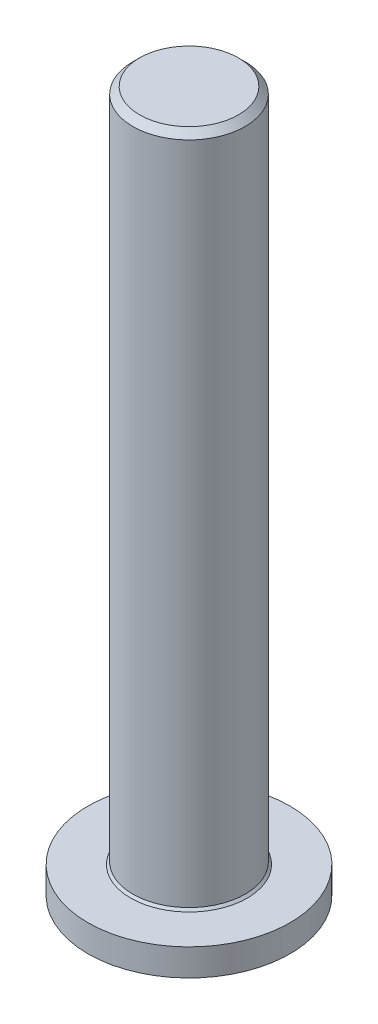
ISO-10303-21;
HEADER;
FILE_DESCRIPTION(('STEP AP214'),'2;1');
FILE_NAME('part.step','',(''),(''),'','','');
FILE_SCHEMA(('AUTOMOTIVE_DESIGN { 1 0 10303 214 1 1 1 1 }'));
ENDSEC;
DATA;
#1=APPLICATION_CONTEXT('core data for automotive mechanical design processes');
#2=APPLICATION_PROTOCOL_DEFINITION('international standard','automotive_design',2000,#1);
#3=PRODUCT_CONTEXT('',#1,'mechanical');
#4=PRODUCT('Part','Part','',(#3));
#5=PRODUCT_RELATED_PRODUCT_CATEGORY('part','',(#4));
#6=PRODUCT_DEFINITION_FORMATION('','',#4);
#7=PRODUCT_DEFINITION_CONTEXT('part definition',#1,'design');
#8=PRODUCT_DEFINITION('design','',#6,#7);
#9=PRODUCT_DEFINITION_SHAPE('','',#8);
#10=(LENGTH_UNIT() NAMED_UNIT(*) SI_UNIT(.MILLI.,.METRE.));
#11=(NAMED_UNIT(*) PLANE_ANGLE_UNIT() SI_UNIT($,.RADIAN.));
#12=(NAMED_UNIT(*) SI_UNIT($,.STERADIAN.) SOLID_ANGLE_UNIT());
#13=UNCERTAINTY_MEASURE_WITH_UNIT(LENGTH_MEASURE(1.E-05),#10,'distance_accuracy_value','');
#14=(GEOMETRIC_REPRESENTATION_CONTEXT(3) GLOBAL_UNCERTAINTY_ASSIGNED_CONTEXT((#13)) GLOBAL_UNIT_ASSIGNED_CONTEXT((#10,
#11,#12)) REPRESENTATION_CONTEXT('',''));
#15=CARTESIAN_POINT('',(0.,0.,0.));
#16=DIRECTION('',(0.,0.,1.));
#17=DIRECTION('',(1.,0.,0.));
#18=AXIS2_PLACEMENT_3D('',#15,#16,#17);
#19=CARTESIAN_POINT('',(0.,1.5,0.));
#20=DIRECTION('',(0.,1.,0.));
#21=DIRECTION('',(0.,0.,1.));
#22=AXIS2_PLACEMENT_3D('',#19,#20,#21);
#23=PLANE('',#22);
#24=CARTESIAN_POINT('',(0.,1.5,0.));
#25=DIRECTION('',(0.,1.,0.));
#26=DIRECTION('',(0.,0.,1.));
#27=AXIS2_PLACEMENT_3D('',#24,#25,#26);
#28=CIRCLE('',#27,2.59999999999999);
#29=CARTESIAN_POINT('',(0.,1.5,2.59999999999999));
#30=VERTEX_POINT('',#29);
#31=EDGE_CURVE('E147',#30,#30,#28,.F.);
#32=ORIENTED_EDGE('',*,*,#31,.T.);
#33=EDGE_LOOP('',(#32));
#34=FACE_BOUND('',#33,.T.);
#35=CARTESIAN_POINT('',(0.,1.5,0.));
#36=DIRECTION('',(0.,1.,0.));
#37=DIRECTION('',(0.,0.,1.));
#38=AXIS2_PLACEMENT_3D('',#35,#36,#37);
#39=CIRCLE('',#38,4.5);
#40=CARTESIAN_POINT('',(0.,1.5,4.5));
#41=VERTEX_POINT('',#40);
#42=EDGE_CURVE('E136',#41,#41,#39,.T.);
#43=ORIENTED_EDGE('',*,*,#42,.T.);
#44=EDGE_LOOP('',(#43));
#45=FACE_BOUND('',#44,.T.);
#46=ADVANCED_FACE('F34',(#34,#45),#23,.T.);
#47=CARTESIAN_POINT('',(0.,1.5,0.));
#48=DIRECTION('',(0.,-1.,0.));
#49=DIRECTION('',(0.,0.,-1.));
#50=AXIS2_PLACEMENT_3D('',#47,#48,#49);
#51=CYLINDRICAL_SURFACE('',#50,4.5);
#52=CARTESIAN_POINT('',(0.,0.3,0.));
#53=DIRECTION('',(0.,1.,0.));
#54=DIRECTION('',(0.,0.,1.));
#55=AXIS2_PLACEMENT_3D('',#52,#53,#54);
#56=CIRCLE('',#55,4.5);
#57=CARTESIAN_POINT('',(0.,0.3,4.5));
#58=VERTEX_POINT('',#57);
#59=EDGE_CURVE('E150',#58,#58,#56,.T.);
#60=ORIENTED_EDGE('',*,*,#59,.T.);
#61=EDGE_LOOP('',(#60));
#62=FACE_BOUND('',#61,.T.);
#63=ORIENTED_EDGE('',*,*,#42,.F.);
#64=EDGE_LOOP('',(#63));
#65=FACE_BOUND('',#64,.T.);
#66=ADVANCED_FACE('F169',(#62,#65),#51,.T.);
#67=CARTESIAN_POINT('',(0.,0.,0.));
#68=DIRECTION('',(0.,1.,0.));
#69=DIRECTION('',(0.,0.,1.));
#70=AXIS2_PLACEMENT_3D('',#67,#68,#69);
#71=PLANE('',#70);
#72=DIRECTION('',(-0.717801415460528,0.,-0.696247892609279));
#73=VECTOR('',#72,1.);
#74=CARTESIAN_POINT('',(-0.422737578252671,0.,1.6796704855218));
#75=LINE('',#74,#73);
#76=CARTESIAN_POINT('',(-0.422737578252671,0.,1.6796704855218));
#77=VERTEX_POINT('',#76);
#78=CARTESIAN_POINT('',(-1.66600609957516,0.,0.473733760859775));
#79=VERTEX_POINT('',#78);
#80=EDGE_CURVE('E123',#77,#79,#75,.T.);
#81=ORIENTED_EDGE('',*,*,#80,.F.);
#82=DIRECTION('',(-0.961869070061279,0.,0.273510314356606));
#83=VECTOR('',#82,1.);
#84=CARTESIAN_POINT('',(1.24326852132249,0.,1.20593672466203));
#85=LINE('',#84,#83);
#86=CARTESIAN_POINT('',(1.24326852132249,0.,1.20593672466203));
#87=VERTEX_POINT('',#86);
#88=EDGE_CURVE('E49',#87,#77,#85,.T.);
#89=ORIENTED_EDGE('',*,*,#88,.F.);
#90=DIRECTION('',(-0.244067654600751,0.,0.969758206965885));
#91=VECTOR('',#90,1.);
#92=CARTESIAN_POINT('',(1.66600609957516,0.,-0.473733760859776));
#93=LINE('',#92,#91);
#94=CARTESIAN_POINT('',(1.66600609957516,0.,-0.473733760859776));
#95=VERTEX_POINT('',#94);
#96=EDGE_CURVE('E132',#95,#87,#93,.T.);
#97=ORIENTED_EDGE('',*,*,#96,.F.);
#98=DIRECTION('',(0.717801415460528,0.,0.696247892609279));
#99=VECTOR('',#98,1.);
#100=CARTESIAN_POINT('',(0.422737578252671,0.,-1.6796704855218));
#101=LINE('',#100,#99);
#102=CARTESIAN_POINT('',(0.422737578252671,0.,-1.6796704855218));
#103=VERTEX_POINT('',#102);
#104=EDGE_CURVE('E130',#103,#95,#101,.T.);
#105=ORIENTED_EDGE('',*,*,#104,.F.);
#106=DIRECTION('',(0.961869070061279,0.,-0.273510314356606));
#107=VECTOR('',#106,1.);
#108=CARTESIAN_POINT('',(-1.24326852132249,0.,-1.20593672466203));
#109=LINE('',#108,#107);
#110=CARTESIAN_POINT('',(-1.24326852132249,0.,-1.20593672466203));
#111=VERTEX_POINT('',#110);
#112=EDGE_CURVE('E97',#111,#103,#109,.T.);
#113=ORIENTED_EDGE('',*,*,#112,.F.);
#114=DIRECTION('',(0.244067654600751,0.,-0.969758206965885));
#115=VECTOR('',#114,1.);
#116=CARTESIAN_POINT('',(-1.66600609957516,0.,0.473733760859775));
#117=LINE('',#116,#115);
#118=EDGE_CURVE('E126',#79,#111,#117,.T.);
#119=ORIENTED_EDGE('',*,*,#118,.F.);
#120=EDGE_LOOP('',(#81,#89,#97,#105,#113,#119));
#121=FACE_BOUND('',#120,.T.);
#122=CARTESIAN_POINT('',(0.,0.,0.));
#123=DIRECTION('',(0.,1.,0.));
#124=DIRECTION('',(0.,0.,1.));
#125=AXIS2_PLACEMENT_3D('',#122,#123,#124);
#126=CIRCLE('',#125,3.75);
#127=CARTESIAN_POINT('',(0.,0.,3.75));
#128=VERTEX_POINT('',#127);
#129=EDGE_CURVE('E153',#128,#128,#126,.F.);
#130=ORIENTED_EDGE('',*,*,#129,.T.);
#131=EDGE_LOOP('',(#130));
#132=FACE_BOUND('',#131,.T.);
#133=ADVANCED_FACE('F175',(#121,#132),#71,.F.);
#134=CARTESIAN_POINT('',(0.,31.5,0.));
#135=DIRECTION('',(0.,-1.,0.));
#136=DIRECTION('',(0.,0.,-1.));
#137=AXIS2_PLACEMENT_3D('',#134,#135,#136);
#138=CYLINDRICAL_SURFACE('',#137,2.5);
#139=CARTESIAN_POINT('',(0.,31.2,0.));
#140=DIRECTION('',(0.,1.,0.));
#141=DIRECTION('',(0.,0.,1.));
#142=AXIS2_PLACEMENT_3D('',#139,#140,#141);
#143=CIRCLE('',#142,2.5);
#144=CARTESIAN_POINT('',(0.,31.2,2.5));
#145=VERTEX_POINT('',#144);
#146=EDGE_CURVE('E11',#145,#145,#143,.F.);
#147=ORIENTED_EDGE('',*,*,#146,.T.);
#148=EDGE_LOOP('',(#147));
#149=FACE_BOUND('',#148,.T.);
#150=CARTESIAN_POINT('',(0.,1.59999999999999,0.));
#151=DIRECTION('',(0.,1.,0.));
#152=DIRECTION('',(0.,0.,1.));
#153=AXIS2_PLACEMENT_3D('',#150,#151,#152);
#154=CIRCLE('',#153,2.5);
#155=CARTESIAN_POINT('',(0.,1.59999999999999,2.5));
#156=VERTEX_POINT('',#155);
#157=EDGE_CURVE('E144',#156,#156,#154,.T.);
#158=ORIENTED_EDGE('',*,*,#157,.T.);
#159=EDGE_LOOP('',(#158));
#160=FACE_BOUND('',#159,.T.);
#161=ADVANCED_FACE('F181',(#149,#160),#138,.T.);
#162=CARTESIAN_POINT('',(0.,31.5,0.));
#163=DIRECTION('',(0.,1.,0.));
#164=DIRECTION('',(0.,0.,1.));
#165=AXIS2_PLACEMENT_3D('',#162,#163,#164);
#166=PLANE('',#165);
#167=CARTESIAN_POINT('',(0.,31.5,0.));
#168=DIRECTION('',(0.,1.,0.));
#169=DIRECTION('',(0.,0.,1.));
#170=AXIS2_PLACEMENT_3D('',#167,#168,#169);
#171=CIRCLE('',#170,2.2);
#172=CARTESIAN_POINT('',(0.,31.5,2.2));
#173=VERTEX_POINT('',#172);
#174=EDGE_CURVE('E42',#173,#173,#171,.T.);
#175=ORIENTED_EDGE('',*,*,#174,.T.);
#176=EDGE_LOOP('',(#175));
#177=FACE_BOUND('',#176,.T.);
#178=ADVANCED_FACE('F158',(#177),#166,.T.);
#179=CARTESIAN_POINT('',(0.,1.59999999999999,0.));
#180=DIRECTION('',(0.,-1.,0.));
#181=DIRECTION('',(0.,0.,-1.));
#182=AXIS2_PLACEMENT_3D('',#179,#180,#181);
#183=CONICAL_SURFACE('',#182,2.5,0.785398163397459);
#184=ORIENTED_EDGE('',*,*,#31,.F.);
#185=EDGE_LOOP('',(#184));
#186=FACE_BOUND('',#185,.T.);
#187=ORIENTED_EDGE('',*,*,#157,.F.);
#188=EDGE_LOOP('',(#187));
#189=FACE_BOUND('',#188,.T.);
#190=ADVANCED_FACE('F186',(#186,#189),#183,.T.);
#191=CARTESIAN_POINT('',(0.,0.3,0.));
#192=DIRECTION('',(0.,1.,0.));
#193=DIRECTION('',(0.,0.,1.));
#194=AXIS2_PLACEMENT_3D('',#191,#192,#193);
#195=CONICAL_SURFACE('',#194,4.5,1.19028994968253);
#196=ORIENTED_EDGE('',*,*,#129,.F.);
#197=EDGE_LOOP('',(#196));
#198=FACE_BOUND('',#197,.T.);
#199=ORIENTED_EDGE('',*,*,#59,.F.);
#200=EDGE_LOOP('',(#199));
#201=FACE_BOUND('',#200,.T.);
#202=ADVANCED_FACE('F188',(#198,#201),#195,.T.);
#203=CARTESIAN_POINT('',(1.24326852132249,3.,1.20593672466203));
#204=DIRECTION('',(0.273510314356606,0.,0.961869070061279));
#205=DIRECTION('',(0.961869070061279,0.,-0.273510314356606));
#206=AXIS2_PLACEMENT_3D('',#203,#204,#205);
#207=PLANE('',#206);
#208=ORIENTED_EDGE('',*,*,#88,.T.);
#209=DIRECTION('',(0.,-1.,0.));
#210=VECTOR('',#209,1.);
#211=CARTESIAN_POINT('',(-0.422737578252671,3.,1.6796704855218));
#212=LINE('',#211,#210);
#213=CARTESIAN_POINT('',(-0.422737578252671,3.,1.6796704855218));
#214=VERTEX_POINT('',#213);
#215=EDGE_CURVE('E79',#214,#77,#212,.T.);
#216=ORIENTED_EDGE('',*,*,#215,.F.);
#217=DIRECTION('',(-0.961869070061279,0.,0.273510314356606));
#218=VECTOR('',#217,1.);
#219=CARTESIAN_POINT('',(1.24326852132249,3.,1.20593672466203));
#220=LINE('',#219,#218);
#221=CARTESIAN_POINT('',(1.24326852132249,3.,1.20593672466203));
#222=VERTEX_POINT('',#221);
#223=EDGE_CURVE('E134',#222,#214,#220,.T.);
#224=ORIENTED_EDGE('',*,*,#223,.F.);
#225=DIRECTION('',(0.,-1.,0.));
#226=VECTOR('',#225,1.);
#227=CARTESIAN_POINT('',(1.24326852132249,3.,1.20593672466203));
#228=LINE('',#227,#226);
#229=EDGE_CURVE('E57',#222,#87,#228,.T.);
#230=ORIENTED_EDGE('',*,*,#229,.T.);
#231=EDGE_LOOP('',(#208,#216,#224,#230));
#232=FACE_BOUND('',#231,.T.);
#233=ADVANCED_FACE('F191',(#232),#207,.F.);
#234=CARTESIAN_POINT('',(1.66600609957516,3.,-0.473733760859776));
#235=DIRECTION('',(0.969758206965885,0.,0.244067654600751));
#236=DIRECTION('',(0.244067654600751,0.,-0.969758206965885));
#237=AXIS2_PLACEMENT_3D('',#234,#235,#236);
#238=PLANE('',#237);
#239=ORIENTED_EDGE('',*,*,#96,.T.);
#240=ORIENTED_EDGE('',*,*,#229,.F.);
#241=DIRECTION('',(-0.244067654600751,0.,0.969758206965885));
#242=VECTOR('',#241,1.);
#243=CARTESIAN_POINT('',(1.66600609957516,3.,-0.473733760859776));
#244=LINE('',#243,#242);
#245=CARTESIAN_POINT('',(1.66600609957516,3.,-0.473733760859776));
#246=VERTEX_POINT('',#245);
#247=EDGE_CURVE('E109',#246,#222,#244,.T.);
#248=ORIENTED_EDGE('',*,*,#247,.F.);
#249=DIRECTION('',(0.,-1.,0.));
#250=VECTOR('',#249,1.);
#251=CARTESIAN_POINT('',(1.66600609957516,3.,-0.473733760859776));
#252=LINE('',#251,#250);
#253=EDGE_CURVE('E101',#246,#95,#252,.T.);
#254=ORIENTED_EDGE('',*,*,#253,.T.);
#255=EDGE_LOOP('',(#239,#240,#248,#254));
#256=FACE_BOUND('',#255,.T.);
#257=ADVANCED_FACE('F196',(#256),#238,.F.);
#258=CARTESIAN_POINT('',(0.422737578252671,3.,-1.6796704855218));
#259=DIRECTION('',(0.696247892609279,0.,-0.717801415460528));
#260=DIRECTION('',(-0.717801415460528,0.,-0.696247892609279));
#261=AXIS2_PLACEMENT_3D('',#258,#259,#260);
#262=PLANE('',#261);
#263=ORIENTED_EDGE('',*,*,#104,.T.);
#264=ORIENTED_EDGE('',*,*,#253,.F.);
#265=DIRECTION('',(0.717801415460528,0.,0.696247892609279));
#266=VECTOR('',#265,1.);
#267=CARTESIAN_POINT('',(0.422737578252671,3.,-1.6796704855218));
#268=LINE('',#267,#266);
#269=CARTESIAN_POINT('',(0.422737578252671,3.,-1.6796704855218));
#270=VERTEX_POINT('',#269);
#271=EDGE_CURVE('E105',#270,#246,#268,.T.);
#272=ORIENTED_EDGE('',*,*,#271,.F.);
#273=DIRECTION('',(0.,-1.,0.));
#274=VECTOR('',#273,1.);
#275=CARTESIAN_POINT('',(0.422737578252671,3.,-1.6796704855218));
#276=LINE('',#275,#274);
#277=EDGE_CURVE('E90',#270,#103,#276,.T.);
#278=ORIENTED_EDGE('',*,*,#277,.T.);
#279=EDGE_LOOP('',(#263,#264,#272,#278));
#280=FACE_BOUND('',#279,.T.);
#281=ADVANCED_FACE('F106',(#280),#262,.F.);
#282=CARTESIAN_POINT('',(-1.24326852132249,3.,-1.20593672466203));
#283=DIRECTION('',(-0.273510314356606,0.,-0.961869070061279));
#284=DIRECTION('',(-0.961869070061279,0.,0.273510314356606));
#285=AXIS2_PLACEMENT_3D('',#282,#283,#284);
#286=PLANE('',#285);
#287=ORIENTED_EDGE('',*,*,#112,.T.);
#288=ORIENTED_EDGE('',*,*,#277,.F.);
#289=DIRECTION('',(0.961869070061279,0.,-0.273510314356606));
#290=VECTOR('',#289,1.);
#291=CARTESIAN_POINT('',(-1.24326852132249,3.,-1.20593672466203));
#292=LINE('',#291,#290);
#293=CARTESIAN_POINT('',(-1.24326852132249,3.,-1.20593672466203));
#294=VERTEX_POINT('',#293);
#295=EDGE_CURVE('E94',#294,#270,#292,.T.);
#296=ORIENTED_EDGE('',*,*,#295,.F.);
#297=DIRECTION('',(0.,-1.,0.));
#298=VECTOR('',#297,1.);
#299=CARTESIAN_POINT('',(-1.24326852132249,3.,-1.20593672466203));
#300=LINE('',#299,#298);
#301=EDGE_CURVE('E102',#294,#111,#300,.T.);
#302=ORIENTED_EDGE('',*,*,#301,.T.);
#303=EDGE_LOOP('',(#287,#288,#296,#302));
#304=FACE_BOUND('',#303,.T.);
#305=ADVANCED_FACE('F92',(#304),#286,.F.);
#306=CARTESIAN_POINT('',(-1.66600609957516,3.,0.473733760859775));
#307=DIRECTION('',(-0.969758206965885,0.,-0.244067654600751));
#308=DIRECTION('',(-0.244067654600751,0.,0.969758206965885));
#309=AXIS2_PLACEMENT_3D('',#306,#307,#308);
#310=PLANE('',#309);
#311=ORIENTED_EDGE('',*,*,#118,.T.);
#312=ORIENTED_EDGE('',*,*,#301,.F.);
#313=DIRECTION('',(0.244067654600751,0.,-0.969758206965885));
#314=VECTOR('',#313,1.);
#315=CARTESIAN_POINT('',(-1.66600609957516,3.,0.473733760859775));
#316=LINE('',#315,#314);
#317=CARTESIAN_POINT('',(-1.66600609957516,3.,0.473733760859775));
#318=VERTEX_POINT('',#317);
#319=EDGE_CURVE('E115',#318,#294,#316,.T.);
#320=ORIENTED_EDGE('',*,*,#319,.F.);
#321=DIRECTION('',(0.,-1.,0.));
#322=VECTOR('',#321,1.);
#323=CARTESIAN_POINT('',(-1.66600609957516,3.,0.473733760859775));
#324=LINE('',#323,#322);
#325=EDGE_CURVE('E139',#318,#79,#324,.T.);
#326=ORIENTED_EDGE('',*,*,#325,.T.);
#327=EDGE_LOOP('',(#311,#312,#320,#326));
#328=FACE_BOUND('',#327,.T.);
#329=ADVANCED_FACE('F265',(#328),#310,.F.);
#330=CARTESIAN_POINT('',(-0.422737578252671,3.,1.6796704855218));
#331=DIRECTION('',(-0.696247892609279,0.,0.717801415460528));
#332=DIRECTION('',(0.717801415460528,0.,0.696247892609279));
#333=AXIS2_PLACEMENT_3D('',#330,#331,#332);
#334=PLANE('',#333);
#335=ORIENTED_EDGE('',*,*,#80,.T.);
#336=ORIENTED_EDGE('',*,*,#325,.F.);
#337=DIRECTION('',(-0.717801415460528,0.,-0.696247892609279));
#338=VECTOR('',#337,1.);
#339=CARTESIAN_POINT('',(-0.422737578252671,3.,1.6796704855218));
#340=LINE('',#339,#338);
#341=EDGE_CURVE('E117',#214,#318,#340,.T.);
#342=ORIENTED_EDGE('',*,*,#341,.F.);
#343=ORIENTED_EDGE('',*,*,#215,.T.);
#344=EDGE_LOOP('',(#335,#336,#342,#343));
#345=FACE_BOUND('',#344,.T.);
#346=ADVANCED_FACE('F165',(#345),#334,.F.);
#347=CARTESIAN_POINT('',(0.,3.,0.));
#348=DIRECTION('',(0.,-1.,0.));
#349=DIRECTION('',(0.,0.,-1.));
#350=AXIS2_PLACEMENT_3D('',#347,#348,#349);
#351=PLANE('',#350);
#352=ORIENTED_EDGE('',*,*,#223,.T.);
#353=ORIENTED_EDGE('',*,*,#341,.T.);
#354=ORIENTED_EDGE('',*,*,#319,.T.);
#355=ORIENTED_EDGE('',*,*,#295,.T.);
#356=ORIENTED_EDGE('',*,*,#271,.T.);
#357=ORIENTED_EDGE('',*,*,#247,.T.);
#358=EDGE_LOOP('',(#352,#353,#354,#355,#356,#357));
#359=FACE_BOUND('',#358,.T.);
#360=ADVANCED_FACE('F112',(#359),#351,.T.);
#361=CARTESIAN_POINT('',(0.,31.5,0.));
#362=DIRECTION('',(0.,-1.,0.));
#363=DIRECTION('',(0.,0.,-1.));
#364=AXIS2_PLACEMENT_3D('',#361,#362,#363);
#365=CONICAL_SURFACE('',#364,2.2,0.78539816339745);
#366=ORIENTED_EDGE('',*,*,#146,.F.);
#367=EDGE_LOOP('',(#366));
#368=FACE_BOUND('',#367,.T.);
#369=ORIENTED_EDGE('',*,*,#174,.F.);
#370=EDGE_LOOP('',(#369));
#371=FACE_BOUND('',#370,.T.);
#372=ADVANCED_FACE('F36',(#368,#371),#365,.T.);
#373=CLOSED_SHELL('',(#46,#66,#133,#161,#178,#190,#202,#233,#257,#281,#305,#329,#346,#360,#372));
#374=MANIFOLD_SOLID_BREP('B2',#373);
#375=ADVANCED_BREP_SHAPE_REPRESENTATION('',(#18,#374),#14);
#376=SHAPE_DEFINITION_REPRESENTATION(#9,#375);
ENDSEC;
END-ISO-10303-21;
